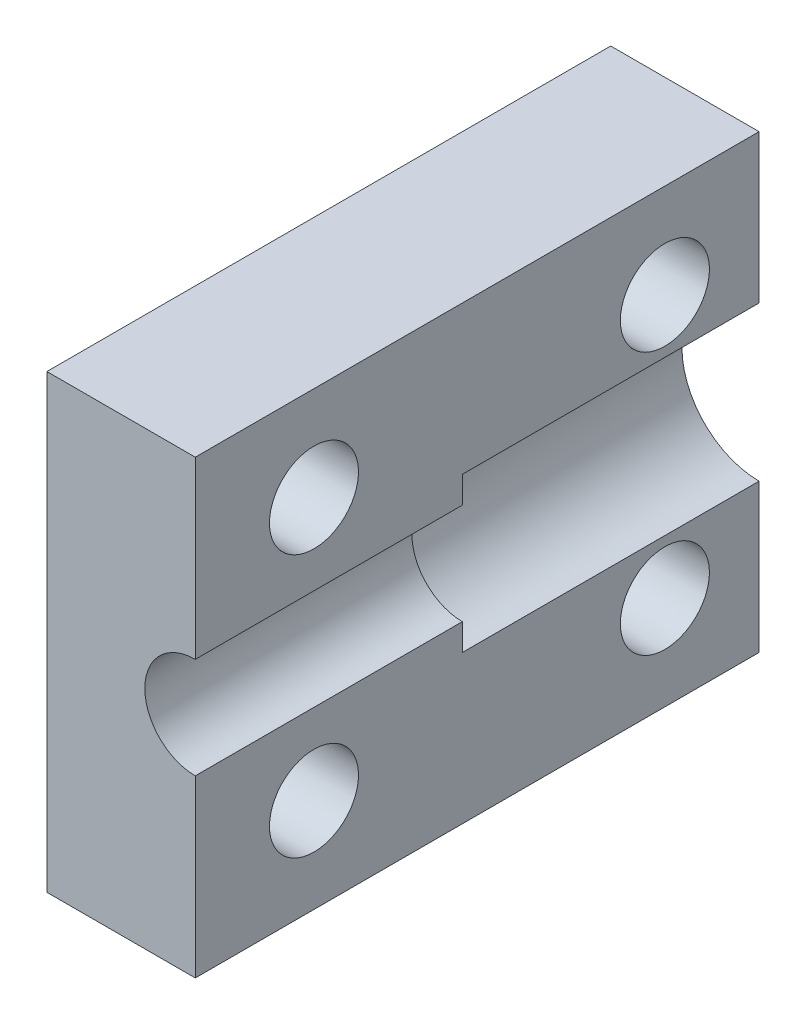
ISO-10303-21;
HEADER;
FILE_DESCRIPTION(('STEP AP214'),'2;1');
FILE_NAME('part.step','',(''),(''),'','','');
FILE_SCHEMA(('AUTOMOTIVE_DESIGN { 1 0 10303 214 1 1 1 1 }'));
ENDSEC;
DATA;
#1=APPLICATION_CONTEXT('core data for automotive mechanical design processes');
#2=APPLICATION_PROTOCOL_DEFINITION('international standard','automotive_design',2000,#1);
#3=PRODUCT_CONTEXT('',#1,'mechanical');
#4=PRODUCT('Part','Part','',(#3));
#5=PRODUCT_RELATED_PRODUCT_CATEGORY('part','',(#4));
#6=PRODUCT_DEFINITION_FORMATION('','',#4);
#7=PRODUCT_DEFINITION_CONTEXT('part definition',#1,'design');
#8=PRODUCT_DEFINITION('design','',#6,#7);
#9=PRODUCT_DEFINITION_SHAPE('','',#8);
#10=(LENGTH_UNIT() NAMED_UNIT(*) SI_UNIT(.MILLI.,.METRE.));
#11=(NAMED_UNIT(*) PLANE_ANGLE_UNIT() SI_UNIT($,.RADIAN.));
#12=(NAMED_UNIT(*) SI_UNIT($,.STERADIAN.) SOLID_ANGLE_UNIT());
#13=UNCERTAINTY_MEASURE_WITH_UNIT(LENGTH_MEASURE(1.E-05),#10,'distance_accuracy_value','');
#14=(GEOMETRIC_REPRESENTATION_CONTEXT(3) GLOBAL_UNCERTAINTY_ASSIGNED_CONTEXT((#13)) GLOBAL_UNIT_ASSIGNED_CONTEXT((#10,
#11,#12)) REPRESENTATION_CONTEXT('',''));
#15=CARTESIAN_POINT('',(0.,0.,0.));
#16=DIRECTION('',(0.,0.,1.));
#17=DIRECTION('',(1.,0.,0.));
#18=AXIS2_PLACEMENT_3D('',#15,#16,#17);
#19=CARTESIAN_POINT('',(0.,0.,10.));
#20=DIRECTION('',(0.,0.,-1.));
#21=DIRECTION('',(-1.,0.,0.));
#22=AXIS2_PLACEMENT_3D('',#19,#20,#21);
#23=CYLINDRICAL_SURFACE('',#22,2.6);
#24=CARTESIAN_POINT('',(0.,0.,0.));
#25=DIRECTION('',(0.,0.,-1.));
#26=DIRECTION('',(1.,0.,0.));
#27=AXIS2_PLACEMENT_3D('',#24,#25,#26);
#28=CIRCLE('',#27,2.6);
#29=CARTESIAN_POINT('',(0.,-2.6,0.));
#30=VERTEX_POINT('',#29);
#31=CARTESIAN_POINT('',(0.,2.6,0.));
#32=VERTEX_POINT('',#31);
#33=EDGE_CURVE('E94',#30,#32,#28,.T.);
#34=ORIENTED_EDGE('',*,*,#33,.T.);
#35=DIRECTION('',(0.,0.,-1.));
#36=VECTOR('',#35,1.);
#37=CARTESIAN_POINT('',(0.,2.6,10.));
#38=LINE('',#37,#36);
#39=CARTESIAN_POINT('',(0.,2.6,10.));
#40=VERTEX_POINT('',#39);
#41=EDGE_CURVE('E11',#40,#32,#38,.T.);
#42=ORIENTED_EDGE('',*,*,#41,.F.);
#43=CARTESIAN_POINT('',(0.,0.,10.));
#44=DIRECTION('',(0.,0.,-1.));
#45=DIRECTION('',(1.,0.,0.));
#46=AXIS2_PLACEMENT_3D('',#43,#44,#45);
#47=CIRCLE('',#46,2.6);
#48=CARTESIAN_POINT('',(0.,-2.6,10.));
#49=VERTEX_POINT('',#48);
#50=EDGE_CURVE('E95',#49,#40,#47,.T.);
#51=ORIENTED_EDGE('',*,*,#50,.F.);
#52=DIRECTION('',(0.,0.,-1.));
#53=VECTOR('',#52,1.);
#54=CARTESIAN_POINT('',(0.,-2.6,10.));
#55=LINE('',#54,#53);
#56=EDGE_CURVE('E47',#49,#30,#55,.T.);
#57=ORIENTED_EDGE('',*,*,#56,.T.);
#58=EDGE_LOOP('',(#34,#42,#51,#57));
#59=FACE_BOUND('',#58,.T.);
#60=ADVANCED_FACE('F30',(#59),#23,.F.);
#61=CARTESIAN_POINT('',(0.,2.6,10.));
#62=DIRECTION('',(-1.,0.,0.));
#63=DIRECTION('',(0.,0.,1.));
#64=AXIS2_PLACEMENT_3D('',#61,#62,#63);
#65=PLANE('',#64);
#66=CARTESIAN_POINT('',(0.,4.425,15.));
#67=DIRECTION('',(-1.,0.,0.));
#68=DIRECTION('',(0.,0.,1.));
#69=AXIS2_PLACEMENT_3D('',#66,#67,#68);
#70=CIRCLE('',#69,1.5);
#71=CARTESIAN_POINT('',(0.,4.425,16.5));
#72=VERTEX_POINT('',#71);
#73=EDGE_CURVE('E251',#72,#72,#70,.T.);
#74=ORIENTED_EDGE('',*,*,#73,.T.);
#75=EDGE_LOOP('',(#74));
#76=FACE_BOUND('',#75,.T.);
#77=CARTESIAN_POINT('',(0.,4.425,3.175));
#78=DIRECTION('',(-1.,0.,0.));
#79=DIRECTION('',(0.,0.,1.));
#80=AXIS2_PLACEMENT_3D('',#77,#78,#79);
#81=CIRCLE('',#80,1.5);
#82=CARTESIAN_POINT('',(0.,4.425,4.675));
#83=VERTEX_POINT('',#82);
#84=EDGE_CURVE('E165',#83,#83,#81,.T.);
#85=ORIENTED_EDGE('',*,*,#84,.T.);
#86=EDGE_LOOP('',(#85));
#87=FACE_BOUND('',#86,.T.);
#88=DIRECTION('',(0.,1.,0.));
#89=VECTOR('',#88,1.);
#90=CARTESIAN_POINT('',(0.,2.6,0.));
#91=LINE('',#90,#89);
#92=CARTESIAN_POINT('',(0.,7.6,0.));
#93=VERTEX_POINT('',#92);
#94=EDGE_CURVE('E118',#32,#93,#91,.T.);
#95=ORIENTED_EDGE('',*,*,#94,.T.);
#96=DIRECTION('',(0.,0.,-1.));
#97=VECTOR('',#96,1.);
#98=CARTESIAN_POINT('',(0.,7.6,10.));
#99=LINE('',#98,#97);
#100=CARTESIAN_POINT('',(0.,7.6,19.));
#101=VERTEX_POINT('',#100);
#102=EDGE_CURVE('E39',#101,#93,#99,.T.);
#103=ORIENTED_EDGE('',*,*,#102,.F.);
#104=DIRECTION('',(0.,1.,0.));
#105=VECTOR('',#104,1.);
#106=CARTESIAN_POINT('',(0.,1.7,19.));
#107=LINE('',#106,#105);
#108=CARTESIAN_POINT('',(0.,1.7,19.));
#109=VERTEX_POINT('',#108);
#110=EDGE_CURVE('E143',#109,#101,#107,.T.);
#111=ORIENTED_EDGE('',*,*,#110,.F.);
#112=DIRECTION('',(0.,0.,-1.));
#113=VECTOR('',#112,1.);
#114=CARTESIAN_POINT('',(0.,1.7,19.));
#115=LINE('',#114,#113);
#116=CARTESIAN_POINT('',(0.,1.7,10.));
#117=VERTEX_POINT('',#116);
#118=EDGE_CURVE('E119',#109,#117,#115,.T.);
#119=ORIENTED_EDGE('',*,*,#118,.T.);
#120=DIRECTION('',(0.,1.,0.));
#121=VECTOR('',#120,1.);
#122=CARTESIAN_POINT('',(0.,1.7,10.));
#123=LINE('',#122,#121);
#124=EDGE_CURVE('E114',#117,#40,#123,.T.);
#125=ORIENTED_EDGE('',*,*,#124,.T.);
#126=ORIENTED_EDGE('',*,*,#41,.T.);
#127=EDGE_LOOP('',(#95,#103,#111,#119,#125,#126));
#128=FACE_BOUND('',#127,.T.);
#129=ADVANCED_FACE('F140',(#76,#87,#128),#65,.F.);
#130=CARTESIAN_POINT('',(0.,7.6,10.));
#131=DIRECTION('',(0.,-1.,0.));
#132=DIRECTION('',(1.,0.,0.));
#133=AXIS2_PLACEMENT_3D('',#130,#131,#132);
#134=PLANE('',#133);
#135=DIRECTION('',(-1.,0.,0.));
#136=VECTOR('',#135,1.);
#137=CARTESIAN_POINT('',(0.,7.6,0.));
#138=LINE('',#137,#136);
#139=CARTESIAN_POINT('',(-5.,7.6,0.));
#140=VERTEX_POINT('',#139);
#141=EDGE_CURVE('E121',#93,#140,#138,.T.);
#142=ORIENTED_EDGE('',*,*,#141,.T.);
#143=DIRECTION('',(0.,0.,-1.));
#144=VECTOR('',#143,1.);
#145=CARTESIAN_POINT('',(-5.,7.6,10.));
#146=LINE('',#145,#144);
#147=CARTESIAN_POINT('',(-5.,7.6,19.));
#148=VERTEX_POINT('',#147);
#149=EDGE_CURVE('E102',#148,#140,#146,.T.);
#150=ORIENTED_EDGE('',*,*,#149,.F.);
#151=DIRECTION('',(-1.,0.,0.));
#152=VECTOR('',#151,1.);
#153=CARTESIAN_POINT('',(0.,7.6,19.));
#154=LINE('',#153,#152);
#155=EDGE_CURVE('E136',#101,#148,#154,.T.);
#156=ORIENTED_EDGE('',*,*,#155,.F.);
#157=ORIENTED_EDGE('',*,*,#102,.T.);
#158=EDGE_LOOP('',(#142,#150,#156,#157));
#159=FACE_BOUND('',#158,.T.);
#160=ADVANCED_FACE('F130',(#159),#134,.F.);
#161=CARTESIAN_POINT('',(-5.,-7.6,10.));
#162=DIRECTION('',(1.,0.,0.));
#163=DIRECTION('',(0.,0.,-1.));
#164=AXIS2_PLACEMENT_3D('',#161,#162,#163);
#165=PLANE('',#164);
#166=CARTESIAN_POINT('',(-5.,-4.425,3.175));
#167=DIRECTION('',(-1.,0.,0.));
#168=DIRECTION('',(0.,0.,1.));
#169=AXIS2_PLACEMENT_3D('',#166,#167,#168);
#170=CIRCLE('',#169,1.5);
#171=CARTESIAN_POINT('',(-5.,-4.425,4.675));
#172=VERTEX_POINT('',#171);
#173=EDGE_CURVE('E239',#172,#172,#170,.T.);
#174=ORIENTED_EDGE('',*,*,#173,.F.);
#175=EDGE_LOOP('',(#174));
#176=FACE_BOUND('',#175,.T.);
#177=CARTESIAN_POINT('',(-5.,-4.425,15.));
#178=DIRECTION('',(-1.,0.,0.));
#179=DIRECTION('',(0.,0.,1.));
#180=AXIS2_PLACEMENT_3D('',#177,#178,#179);
#181=CIRCLE('',#180,1.5);
#182=CARTESIAN_POINT('',(-5.,-4.425,16.5));
#183=VERTEX_POINT('',#182);
#184=EDGE_CURVE('E242',#183,#183,#181,.T.);
#185=ORIENTED_EDGE('',*,*,#184,.F.);
#186=EDGE_LOOP('',(#185));
#187=FACE_BOUND('',#186,.T.);
#188=CARTESIAN_POINT('',(-5.,4.425,15.));
#189=DIRECTION('',(-1.,0.,0.));
#190=DIRECTION('',(0.,0.,1.));
#191=AXIS2_PLACEMENT_3D('',#188,#189,#190);
#192=CIRCLE('',#191,1.5);
#193=CARTESIAN_POINT('',(-5.,4.425,16.5));
#194=VERTEX_POINT('',#193);
#195=EDGE_CURVE('E248',#194,#194,#192,.T.);
#196=ORIENTED_EDGE('',*,*,#195,.F.);
#197=EDGE_LOOP('',(#196));
#198=FACE_BOUND('',#197,.T.);
#199=CARTESIAN_POINT('',(-5.,4.425,3.175));
#200=DIRECTION('',(-1.,0.,0.));
#201=DIRECTION('',(0.,0.,1.));
#202=AXIS2_PLACEMENT_3D('',#199,#200,#201);
#203=CIRCLE('',#202,1.5);
#204=CARTESIAN_POINT('',(-5.,4.425,4.675));
#205=VERTEX_POINT('',#204);
#206=EDGE_CURVE('E253',#205,#205,#203,.T.);
#207=ORIENTED_EDGE('',*,*,#206,.F.);
#208=EDGE_LOOP('',(#207));
#209=FACE_BOUND('',#208,.T.);
#210=DIRECTION('',(0.,-1.,0.));
#211=VECTOR('',#210,1.);
#212=CARTESIAN_POINT('',(-5.,-7.6,0.));
#213=LINE('',#212,#211);
#214=CARTESIAN_POINT('',(-5.,-7.6,0.));
#215=VERTEX_POINT('',#214);
#216=EDGE_CURVE('E83',#140,#215,#213,.T.);
#217=ORIENTED_EDGE('',*,*,#216,.T.);
#218=DIRECTION('',(0.,0.,-1.));
#219=VECTOR('',#218,1.);
#220=CARTESIAN_POINT('',(-5.,-7.6,10.));
#221=LINE('',#220,#219);
#222=CARTESIAN_POINT('',(-5.,-7.6,19.));
#223=VERTEX_POINT('',#222);
#224=EDGE_CURVE('E78',#223,#215,#221,.T.);
#225=ORIENTED_EDGE('',*,*,#224,.F.);
#226=DIRECTION('',(0.,-1.,0.));
#227=VECTOR('',#226,1.);
#228=CARTESIAN_POINT('',(-5.,7.6,19.));
#229=LINE('',#228,#227);
#230=EDGE_CURVE('E152',#148,#223,#229,.T.);
#231=ORIENTED_EDGE('',*,*,#230,.F.);
#232=ORIENTED_EDGE('',*,*,#149,.T.);
#233=EDGE_LOOP('',(#217,#225,#231,#232));
#234=FACE_BOUND('',#233,.T.);
#235=ADVANCED_FACE('F123',(#176,#187,#198,#209,#234),#165,.F.);
#236=CARTESIAN_POINT('',(0.,-7.6,10.));
#237=DIRECTION('',(0.,1.,0.));
#238=DIRECTION('',(0.,0.,1.));
#239=AXIS2_PLACEMENT_3D('',#236,#237,#238);
#240=PLANE('',#239);
#241=DIRECTION('',(1.,0.,0.));
#242=VECTOR('',#241,1.);
#243=CARTESIAN_POINT('',(0.,-7.6,0.));
#244=LINE('',#243,#242);
#245=CARTESIAN_POINT('',(0.,-7.6,0.));
#246=VERTEX_POINT('',#245);
#247=EDGE_CURVE('E70',#215,#246,#244,.T.);
#248=ORIENTED_EDGE('',*,*,#247,.T.);
#249=DIRECTION('',(0.,0.,-1.));
#250=VECTOR('',#249,1.);
#251=CARTESIAN_POINT('',(0.,-7.6,10.));
#252=LINE('',#251,#250);
#253=CARTESIAN_POINT('',(0.,-7.6,19.));
#254=VERTEX_POINT('',#253);
#255=EDGE_CURVE('E75',#254,#246,#252,.T.);
#256=ORIENTED_EDGE('',*,*,#255,.F.);
#257=DIRECTION('',(1.,0.,0.));
#258=VECTOR('',#257,1.);
#259=CARTESIAN_POINT('',(-5.,-7.6,19.));
#260=LINE('',#259,#258);
#261=EDGE_CURVE('E159',#223,#254,#260,.T.);
#262=ORIENTED_EDGE('',*,*,#261,.F.);
#263=ORIENTED_EDGE('',*,*,#224,.T.);
#264=EDGE_LOOP('',(#248,#256,#262,#263));
#265=FACE_BOUND('',#264,.T.);
#266=ADVANCED_FACE('F72',(#265),#240,.F.);
#267=CARTESIAN_POINT('',(0.,-2.6,10.));
#268=DIRECTION('',(-1.,0.,0.));
#269=DIRECTION('',(0.,-1.,0.));
#270=AXIS2_PLACEMENT_3D('',#267,#268,#269);
#271=PLANE('',#270);
#272=CARTESIAN_POINT('',(0.,-4.425,3.175));
#273=DIRECTION('',(-1.,0.,0.));
#274=DIRECTION('',(0.,-1.,0.));
#275=AXIS2_PLACEMENT_3D('',#272,#273,#274);
#276=CIRCLE('',#275,1.5);
#277=CARTESIAN_POINT('',(0.,-5.925,3.175));
#278=VERTEX_POINT('',#277);
#279=EDGE_CURVE('E33',#278,#278,#276,.T.);
#280=ORIENTED_EDGE('',*,*,#279,.T.);
#281=EDGE_LOOP('',(#280));
#282=FACE_BOUND('',#281,.T.);
#283=CARTESIAN_POINT('',(0.,-4.425,15.));
#284=DIRECTION('',(-1.,0.,0.));
#285=DIRECTION('',(0.,-1.,0.));
#286=AXIS2_PLACEMENT_3D('',#283,#284,#285);
#287=CIRCLE('',#286,1.5);
#288=CARTESIAN_POINT('',(0.,-5.925,15.));
#289=VERTEX_POINT('',#288);
#290=EDGE_CURVE('E244',#289,#289,#287,.T.);
#291=ORIENTED_EDGE('',*,*,#290,.T.);
#292=EDGE_LOOP('',(#291));
#293=FACE_BOUND('',#292,.T.);
#294=DIRECTION('',(0.,1.,0.));
#295=VECTOR('',#294,1.);
#296=CARTESIAN_POINT('',(0.,-2.6,0.));
#297=LINE('',#296,#295);
#298=EDGE_CURVE('E82',#246,#30,#297,.T.);
#299=ORIENTED_EDGE('',*,*,#298,.T.);
#300=ORIENTED_EDGE('',*,*,#56,.F.);
#301=DIRECTION('',(0.,1.,0.));
#302=VECTOR('',#301,1.);
#303=CARTESIAN_POINT('',(0.,-7.6,10.));
#304=LINE('',#303,#302);
#305=CARTESIAN_POINT('',(0.,-1.7,10.));
#306=VERTEX_POINT('',#305);
#307=EDGE_CURVE('E154',#49,#306,#304,.T.);
#308=ORIENTED_EDGE('',*,*,#307,.T.);
#309=DIRECTION('',(0.,0.,-1.));
#310=VECTOR('',#309,1.);
#311=CARTESIAN_POINT('',(0.,-1.7,19.));
#312=LINE('',#311,#310);
#313=CARTESIAN_POINT('',(0.,-1.7,19.));
#314=VERTEX_POINT('',#313);
#315=EDGE_CURVE('E162',#314,#306,#312,.T.);
#316=ORIENTED_EDGE('',*,*,#315,.F.);
#317=DIRECTION('',(0.,1.,0.));
#318=VECTOR('',#317,1.);
#319=CARTESIAN_POINT('',(0.,-7.6,19.));
#320=LINE('',#319,#318);
#321=EDGE_CURVE('E89',#254,#314,#320,.T.);
#322=ORIENTED_EDGE('',*,*,#321,.F.);
#323=ORIENTED_EDGE('',*,*,#255,.T.);
#324=EDGE_LOOP('',(#299,#300,#308,#316,#322,#323));
#325=FACE_BOUND('',#324,.T.);
#326=ADVANCED_FACE('F86',(#282,#293,#325),#271,.F.);
#327=CARTESIAN_POINT('',(0.,0.,0.));
#328=DIRECTION('',(0.,0.,1.));
#329=DIRECTION('',(1.,0.,0.));
#330=AXIS2_PLACEMENT_3D('',#327,#328,#329);
#331=PLANE('',#330);
#332=ORIENTED_EDGE('',*,*,#33,.F.);
#333=ORIENTED_EDGE('',*,*,#298,.F.);
#334=ORIENTED_EDGE('',*,*,#247,.F.);
#335=ORIENTED_EDGE('',*,*,#216,.F.);
#336=ORIENTED_EDGE('',*,*,#141,.F.);
#337=ORIENTED_EDGE('',*,*,#94,.F.);
#338=EDGE_LOOP('',(#332,#333,#334,#335,#336,#337));
#339=FACE_BOUND('',#338,.T.);
#340=ADVANCED_FACE('F92',(#339),#331,.F.);
#341=CARTESIAN_POINT('',(0.,0.,10.));
#342=DIRECTION('',(0.,0.,1.));
#343=DIRECTION('',(1.,0.,0.));
#344=AXIS2_PLACEMENT_3D('',#341,#342,#343);
#345=PLANE('',#344);
#346=ORIENTED_EDGE('',*,*,#307,.F.);
#347=ORIENTED_EDGE('',*,*,#50,.T.);
#348=ORIENTED_EDGE('',*,*,#124,.F.);
#349=CARTESIAN_POINT('',(0.,0.,10.));
#350=DIRECTION('',(0.,0.,-1.));
#351=DIRECTION('',(1.,0.,0.));
#352=AXIS2_PLACEMENT_3D('',#349,#350,#351);
#353=CIRCLE('',#352,1.7);
#354=EDGE_CURVE('E163',#306,#117,#353,.T.);
#355=ORIENTED_EDGE('',*,*,#354,.F.);
#356=EDGE_LOOP('',(#346,#347,#348,#355));
#357=FACE_BOUND('',#356,.T.);
#358=ADVANCED_FACE('F182',(#357),#345,.F.);
#359=CARTESIAN_POINT('',(0.,0.,19.));
#360=DIRECTION('',(0.,0.,-1.));
#361=DIRECTION('',(-1.,0.,0.));
#362=AXIS2_PLACEMENT_3D('',#359,#360,#361);
#363=CYLINDRICAL_SURFACE('',#362,1.7);
#364=ORIENTED_EDGE('',*,*,#354,.T.);
#365=ORIENTED_EDGE('',*,*,#118,.F.);
#366=CARTESIAN_POINT('',(0.,0.,19.));
#367=DIRECTION('',(0.,0.,-1.));
#368=DIRECTION('',(1.,0.,0.));
#369=AXIS2_PLACEMENT_3D('',#366,#367,#368);
#370=CIRCLE('',#369,1.7);
#371=EDGE_CURVE('E149',#314,#109,#370,.T.);
#372=ORIENTED_EDGE('',*,*,#371,.F.);
#373=ORIENTED_EDGE('',*,*,#315,.T.);
#374=EDGE_LOOP('',(#364,#365,#372,#373));
#375=FACE_BOUND('',#374,.T.);
#376=ADVANCED_FACE('F177',(#375),#363,.F.);
#377=CARTESIAN_POINT('',(0.,0.,19.));
#378=DIRECTION('',(0.,0.,1.));
#379=DIRECTION('',(1.,0.,0.));
#380=AXIS2_PLACEMENT_3D('',#377,#378,#379);
#381=PLANE('',#380);
#382=ORIENTED_EDGE('',*,*,#371,.T.);
#383=ORIENTED_EDGE('',*,*,#110,.T.);
#384=ORIENTED_EDGE('',*,*,#155,.T.);
#385=ORIENTED_EDGE('',*,*,#230,.T.);
#386=ORIENTED_EDGE('',*,*,#261,.T.);
#387=ORIENTED_EDGE('',*,*,#321,.T.);
#388=EDGE_LOOP('',(#382,#383,#384,#385,#386,#387));
#389=FACE_BOUND('',#388,.T.);
#390=ADVANCED_FACE('F147',(#389),#381,.T.);
#391=CARTESIAN_POINT('',(4.99999999997031E-05,4.425,3.175));
#392=DIRECTION('',(-1.,0.,0.));
#393=DIRECTION('',(0.,0.,1.));
#394=AXIS2_PLACEMENT_3D('',#391,#392,#393);
#395=CYLINDRICAL_SURFACE('',#394,1.5);
#396=ORIENTED_EDGE('',*,*,#206,.T.);
#397=EDGE_LOOP('',(#396));
#398=FACE_BOUND('',#397,.T.);
#399=ORIENTED_EDGE('',*,*,#84,.F.);
#400=EDGE_LOOP('',(#399));
#401=FACE_BOUND('',#400,.T.);
#402=ADVANCED_FACE('F219',(#398,#401),#395,.F.);
#403=CARTESIAN_POINT('',(4.99999999997031E-05,4.425,15.));
#404=DIRECTION('',(-1.,0.,0.));
#405=DIRECTION('',(0.,0.,1.));
#406=AXIS2_PLACEMENT_3D('',#403,#404,#405);
#407=CYLINDRICAL_SURFACE('',#406,1.5);
#408=ORIENTED_EDGE('',*,*,#195,.T.);
#409=EDGE_LOOP('',(#408));
#410=FACE_BOUND('',#409,.T.);
#411=ORIENTED_EDGE('',*,*,#73,.F.);
#412=EDGE_LOOP('',(#411));
#413=FACE_BOUND('',#412,.T.);
#414=ADVANCED_FACE('F222',(#410,#413),#407,.F.);
#415=CARTESIAN_POINT('',(4.99999999997031E-05,-4.425,15.));
#416=DIRECTION('',(-1.,0.,0.));
#417=DIRECTION('',(0.,0.,1.));
#418=AXIS2_PLACEMENT_3D('',#415,#416,#417);
#419=CYLINDRICAL_SURFACE('',#418,1.5);
#420=ORIENTED_EDGE('',*,*,#184,.T.);
#421=EDGE_LOOP('',(#420));
#422=FACE_BOUND('',#421,.T.);
#423=ORIENTED_EDGE('',*,*,#290,.F.);
#424=EDGE_LOOP('',(#423));
#425=FACE_BOUND('',#424,.T.);
#426=ADVANCED_FACE('F226',(#422,#425),#419,.F.);
#427=CARTESIAN_POINT('',(4.99999999997031E-05,-4.425,3.175));
#428=DIRECTION('',(-1.,0.,0.));
#429=DIRECTION('',(0.,0.,1.));
#430=AXIS2_PLACEMENT_3D('',#427,#428,#429);
#431=CYLINDRICAL_SURFACE('',#430,1.5);
#432=ORIENTED_EDGE('',*,*,#173,.T.);
#433=EDGE_LOOP('',(#432));
#434=FACE_BOUND('',#433,.T.);
#435=ORIENTED_EDGE('',*,*,#279,.F.);
#436=EDGE_LOOP('',(#435));
#437=FACE_BOUND('',#436,.T.);
#438=ADVANCED_FACE('F230',(#434,#437),#431,.F.);
#439=CLOSED_SHELL('',(#60,#129,#160,#235,#266,#326,#340,#358,#376,#390,#402,#414,#426,#438));
#440=MANIFOLD_SOLID_BREP('B2',#439);
#441=ADVANCED_BREP_SHAPE_REPRESENTATION('',(#18,#440),#14);
#442=SHAPE_DEFINITION_REPRESENTATION(#9,#441);
ENDSEC;
END-ISO-10303-21;
